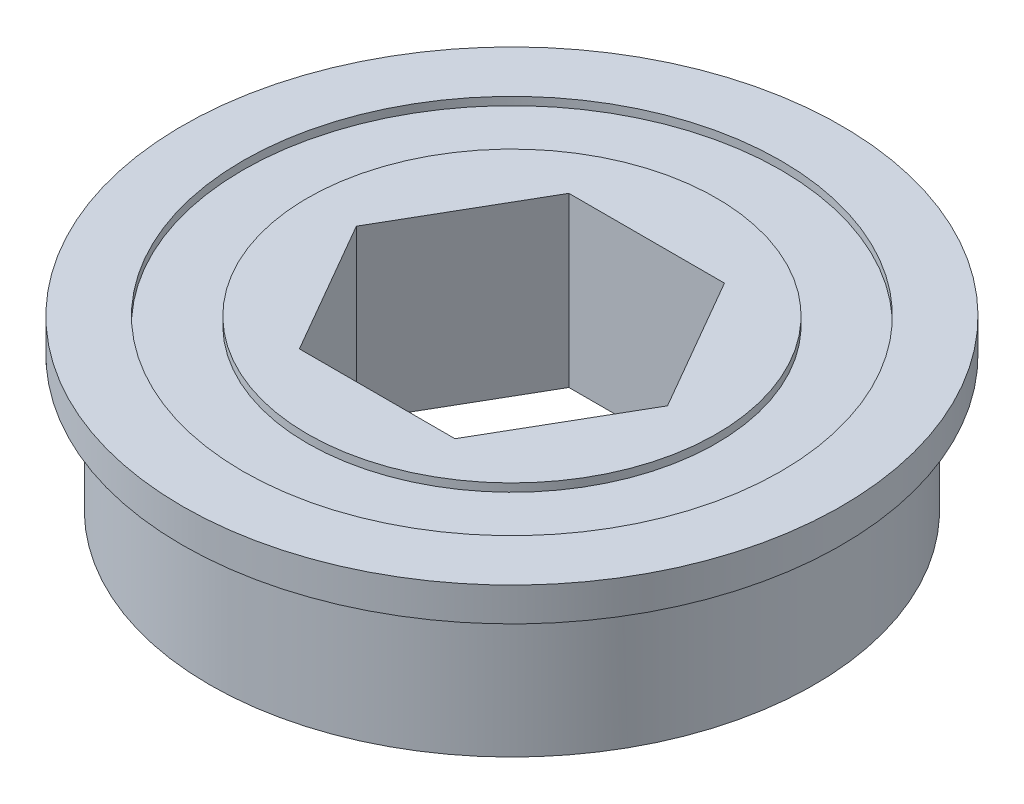
ISO-10303-21;
HEADER;
FILE_DESCRIPTION(('STEP AP214'),'2;1');
FILE_NAME('part.step','',(''),(''),'','','');
FILE_SCHEMA(('AUTOMOTIVE_DESIGN { 1 0 10303 214 1 1 1 1 }'));
ENDSEC;
DATA;
#1=APPLICATION_CONTEXT('core data for automotive mechanical design processes');
#2=APPLICATION_PROTOCOL_DEFINITION('international standard','automotive_design',2000,#1);
#3=PRODUCT_CONTEXT('',#1,'mechanical');
#4=PRODUCT('Part','Part','',(#3));
#5=PRODUCT_RELATED_PRODUCT_CATEGORY('part','',(#4));
#6=PRODUCT_DEFINITION_FORMATION('','',#4);
#7=PRODUCT_DEFINITION_CONTEXT('part definition',#1,'design');
#8=PRODUCT_DEFINITION('design','',#6,#7);
#9=PRODUCT_DEFINITION_SHAPE('','',#8);
#10=(LENGTH_UNIT() NAMED_UNIT(*) SI_UNIT(.MILLI.,.METRE.));
#11=(NAMED_UNIT(*) PLANE_ANGLE_UNIT() SI_UNIT($,.RADIAN.));
#12=(NAMED_UNIT(*) SI_UNIT($,.STERADIAN.) SOLID_ANGLE_UNIT());
#13=UNCERTAINTY_MEASURE_WITH_UNIT(LENGTH_MEASURE(1.E-05),#10,'distance_accuracy_value','');
#14=(GEOMETRIC_REPRESENTATION_CONTEXT(3) GLOBAL_UNCERTAINTY_ASSIGNED_CONTEXT((#13)) GLOBAL_UNIT_ASSIGNED_CONTEXT((#10,
#11,#12)) REPRESENTATION_CONTEXT('',''));
#15=CARTESIAN_POINT('',(0.,0.,0.));
#16=DIRECTION('',(0.,0.,1.));
#17=DIRECTION('',(1.,0.,0.));
#18=AXIS2_PLACEMENT_3D('',#15,#16,#17);
#19=CARTESIAN_POINT('',(9.652,0.,0.));
#20=DIRECTION('',(0.,-1.,0.));
#21=DIRECTION('',(0.,0.,-1.));
#22=AXIS2_PLACEMENT_3D('',#19,#20,#21);
#23=PLANE('',#22);
#24=DIRECTION('',(1.,0.,0.));
#25=VECTOR('',#24,1.);
#26=CARTESIAN_POINT('',(-3.67194771204601,0.,6.36));
#27=LINE('',#26,#25);
#28=CARTESIAN_POINT('',(-3.67194771204601,0.,6.36));
#29=VERTEX_POINT('',#28);
#30=CARTESIAN_POINT('',(3.67194771204602,0.,6.36));
#31=VERTEX_POINT('',#30);
#32=EDGE_CURVE('E91',#29,#31,#27,.T.);
#33=ORIENTED_EDGE('',*,*,#32,.T.);
#34=DIRECTION('',(0.5,0.,-0.866025403784439));
#35=VECTOR('',#34,1.);
#36=CARTESIAN_POINT('',(3.67194771204602,0.,6.36));
#37=LINE('',#36,#35);
#38=CARTESIAN_POINT('',(7.34389542409204,0.,0.));
#39=VERTEX_POINT('',#38);
#40=EDGE_CURVE('E93',#31,#39,#37,.T.);
#41=ORIENTED_EDGE('',*,*,#40,.T.);
#42=DIRECTION('',(-0.5,0.,-0.866025403784439));
#43=VECTOR('',#42,1.);
#44=CARTESIAN_POINT('',(7.34389542409204,0.,0.));
#45=LINE('',#44,#43);
#46=CARTESIAN_POINT('',(3.67194771204602,0.,-6.36));
#47=VERTEX_POINT('',#46);
#48=EDGE_CURVE('E96',#39,#47,#45,.T.);
#49=ORIENTED_EDGE('',*,*,#48,.T.);
#50=DIRECTION('',(-1.,0.,0.));
#51=VECTOR('',#50,1.);
#52=CARTESIAN_POINT('',(3.67194771204602,0.,-6.36));
#53=LINE('',#52,#51);
#54=CARTESIAN_POINT('',(-3.67194771204602,0.,-6.36));
#55=VERTEX_POINT('',#54);
#56=EDGE_CURVE('E233',#47,#55,#53,.T.);
#57=ORIENTED_EDGE('',*,*,#56,.T.);
#58=DIRECTION('',(-0.5,0.,0.866025403784439));
#59=VECTOR('',#58,1.);
#60=CARTESIAN_POINT('',(-3.67194771204602,0.,-6.36));
#61=LINE('',#60,#59);
#62=CARTESIAN_POINT('',(-7.34389542409204,0.,0.));
#63=VERTEX_POINT('',#62);
#64=EDGE_CURVE('E242',#55,#63,#61,.T.);
#65=ORIENTED_EDGE('',*,*,#64,.T.);
#66=DIRECTION('',(0.5,0.,0.866025403784439));
#67=VECTOR('',#66,1.);
#68=CARTESIAN_POINT('',(-7.34389542409204,0.,0.));
#69=LINE('',#68,#67);
#70=EDGE_CURVE('E249',#63,#29,#69,.T.);
#71=ORIENTED_EDGE('',*,*,#70,.T.);
#72=EDGE_LOOP('',(#33,#41,#49,#57,#65,#71));
#73=FACE_BOUND('',#72,.T.);
#74=CARTESIAN_POINT('',(0.,0.,0.));
#75=DIRECTION('',(0.,-1.,0.));
#76=DIRECTION('',(0.,0.,1.));
#77=AXIS2_PLACEMENT_3D('',#74,#75,#76);
#78=CIRCLE('',#77,9.652);
#79=CARTESIAN_POINT('',(0.,0.,9.652));
#80=VERTEX_POINT('',#79);
#81=EDGE_CURVE('E479',#80,#80,#78,.T.);
#82=ORIENTED_EDGE('',*,*,#81,.T.);
#83=EDGE_LOOP('',(#82));
#84=FACE_BOUND('',#83,.T.);
#85=ADVANCED_FACE('F44',(#73,#84),#23,.T.);
#86=CARTESIAN_POINT('',(0.,0.,0.));
#87=DIRECTION('',(0.,1.,0.));
#88=DIRECTION('',(0.,0.,1.));
#89=AXIS2_PLACEMENT_3D('',#86,#87,#88);
#90=CYLINDRICAL_SURFACE('',#89,14.2748);
#91=CARTESIAN_POINT('',(0.,0.,0.));
#92=DIRECTION('',(0.,1.,0.));
#93=DIRECTION('',(0.,0.,1.));
#94=AXIS2_PLACEMENT_3D('',#91,#92,#93);
#95=CIRCLE('',#94,14.2748);
#96=CARTESIAN_POINT('',(0.,0.,14.2748));
#97=VERTEX_POINT('',#96);
#98=EDGE_CURVE('E137',#97,#97,#95,.T.);
#99=ORIENTED_EDGE('',*,*,#98,.T.);
#100=EDGE_LOOP('',(#99));
#101=FACE_BOUND('',#100,.T.);
#102=CARTESIAN_POINT('',(0.,5.6,0.));
#103=DIRECTION('',(0.,-1.,0.));
#104=DIRECTION('',(0.,0.,-1.));
#105=AXIS2_PLACEMENT_3D('',#102,#103,#104);
#106=CIRCLE('',#105,14.2748);
#107=CARTESIAN_POINT('',(0.,5.6,-14.2748));
#108=VERTEX_POINT('',#107);
#109=EDGE_CURVE('E114',#108,#108,#106,.F.);
#110=ORIENTED_EDGE('',*,*,#109,.F.);
#111=EDGE_LOOP('',(#110));
#112=FACE_BOUND('',#111,.T.);
#113=ADVANCED_FACE('F46',(#101,#112),#90,.T.);
#114=CARTESIAN_POINT('',(0.,0.,0.));
#115=DIRECTION('',(0.,-1.,0.));
#116=DIRECTION('',(0.,0.,1.));
#117=AXIS2_PLACEMENT_3D('',#114,#115,#116);
#118=CIRCLE('',#117,12.7);
#119=CARTESIAN_POINT('',(0.,0.,12.7));
#120=VERTEX_POINT('',#119);
#121=EDGE_CURVE('E481',#120,#120,#118,.T.);
#122=ORIENTED_EDGE('',*,*,#121,.F.);
#123=EDGE_LOOP('',(#122));
#124=FACE_BOUND('',#123,.T.);
#125=ORIENTED_EDGE('',*,*,#98,.F.);
#126=EDGE_LOOP('',(#125));
#127=FACE_BOUND('',#126,.T.);
#128=ADVANCED_FACE('F288',(#124,#127),#23,.T.);
#129=CARTESIAN_POINT('',(0.,5.6,0.));
#130=DIRECTION('',(0.,-1.,0.));
#131=DIRECTION('',(0.,0.,-1.));
#132=AXIS2_PLACEMENT_3D('',#129,#130,#131);
#133=CONICAL_SURFACE('',#132,14.2748,0.523598775598298);
#134=CARTESIAN_POINT('',(0.,5.975,0.));
#135=DIRECTION('',(0.,1.,0.));
#136=DIRECTION('',(0.,0.,1.));
#137=AXIS2_PLACEMENT_3D('',#134,#135,#136);
#138=CIRCLE('',#137,14.0582936490539);
#139=CARTESIAN_POINT('',(0.,5.975,14.0582936490539));
#140=VERTEX_POINT('',#139);
#141=EDGE_CURVE('E129',#140,#140,#138,.F.);
#142=ORIENTED_EDGE('',*,*,#141,.T.);
#143=EDGE_LOOP('',(#142));
#144=FACE_BOUND('',#143,.T.);
#145=ORIENTED_EDGE('',*,*,#109,.T.);
#146=EDGE_LOOP('',(#145));
#147=FACE_BOUND('',#146,.T.);
#148=ADVANCED_FACE('F297',(#144,#147),#133,.T.);
#149=CARTESIAN_POINT('',(7.34389542409204,0.,0.));
#150=DIRECTION('',(0.866025403784439,0.,-0.5));
#151=DIRECTION('',(-0.5,0.,-0.866025403784439));
#152=AXIS2_PLACEMENT_3D('',#149,#150,#151);
#153=PLANE('',#152);
#154=DIRECTION('',(0.,1.,0.));
#155=VECTOR('',#154,1.);
#156=CARTESIAN_POINT('',(3.67194771204602,0.,-6.36));
#157=LINE('',#156,#155);
#158=CARTESIAN_POINT('',(3.67194771204602,7.9375,-6.36));
#159=VERTEX_POINT('',#158);
#160=EDGE_CURVE('E111',#159,#47,#157,.F.);
#161=ORIENTED_EDGE('',*,*,#160,.T.);
#162=ORIENTED_EDGE('',*,*,#48,.F.);
#163=DIRECTION('',(0.,1.,0.));
#164=VECTOR('',#163,1.);
#165=CARTESIAN_POINT('',(7.34389542409204,0.,0.));
#166=LINE('',#165,#164);
#167=CARTESIAN_POINT('',(7.34389542409204,7.9375,0.));
#168=VERTEX_POINT('',#167);
#169=EDGE_CURVE('E103',#39,#168,#166,.T.);
#170=ORIENTED_EDGE('',*,*,#169,.T.);
#171=DIRECTION('',(0.5,0.,0.866025403784438));
#172=VECTOR('',#171,1.);
#173=CARTESIAN_POINT('',(3.67194771204602,7.9375,-6.36));
#174=LINE('',#173,#172);
#175=EDGE_CURVE('E133',#159,#168,#174,.T.);
#176=ORIENTED_EDGE('',*,*,#175,.F.);
#177=EDGE_LOOP('',(#161,#162,#170,#176));
#178=FACE_BOUND('',#177,.T.);
#179=ADVANCED_FACE('F107',(#178),#153,.F.);
#180=CARTESIAN_POINT('',(3.67194771204602,0.,6.36));
#181=DIRECTION('',(0.866025403784439,0.,0.5));
#182=DIRECTION('',(0.5,0.,-0.866025403784439));
#183=AXIS2_PLACEMENT_3D('',#180,#181,#182);
#184=PLANE('',#183);
#185=ORIENTED_EDGE('',*,*,#169,.F.);
#186=ORIENTED_EDGE('',*,*,#40,.F.);
#187=DIRECTION('',(0.,1.,0.));
#188=VECTOR('',#187,1.);
#189=CARTESIAN_POINT('',(3.67194771204602,0.,6.36));
#190=LINE('',#189,#188);
#191=CARTESIAN_POINT('',(3.67194771204602,7.9375,6.36));
#192=VERTEX_POINT('',#191);
#193=EDGE_CURVE('E125',#31,#192,#190,.T.);
#194=ORIENTED_EDGE('',*,*,#193,.T.);
#195=DIRECTION('',(-0.5,0.,0.866025403784439));
#196=VECTOR('',#195,1.);
#197=CARTESIAN_POINT('',(7.34389542409204,7.9375,0.));
#198=LINE('',#197,#196);
#199=EDGE_CURVE('E118',#168,#192,#198,.T.);
#200=ORIENTED_EDGE('',*,*,#199,.F.);
#201=EDGE_LOOP('',(#185,#186,#194,#200));
#202=FACE_BOUND('',#201,.T.);
#203=ADVANCED_FACE('F116',(#202),#184,.F.);
#204=CARTESIAN_POINT('',(-3.67194771204601,0.,6.36));
#205=DIRECTION('',(0.,0.,1.));
#206=DIRECTION('',(1.,0.,0.));
#207=AXIS2_PLACEMENT_3D('',#204,#205,#206);
#208=PLANE('',#207);
#209=ORIENTED_EDGE('',*,*,#193,.F.);
#210=ORIENTED_EDGE('',*,*,#32,.F.);
#211=DIRECTION('',(0.,1.,0.));
#212=VECTOR('',#211,1.);
#213=CARTESIAN_POINT('',(-3.67194771204601,0.,6.36));
#214=LINE('',#213,#212);
#215=CARTESIAN_POINT('',(-3.67194771204601,7.9375,6.36));
#216=VERTEX_POINT('',#215);
#217=EDGE_CURVE('E245',#29,#216,#214,.T.);
#218=ORIENTED_EDGE('',*,*,#217,.T.);
#219=DIRECTION('',(1.,0.,0.));
#220=VECTOR('',#219,1.);
#221=CARTESIAN_POINT('',(6.35,7.9375,6.36));
#222=LINE('',#221,#220);
#223=EDGE_CURVE('E222',#192,#216,#222,.F.);
#224=ORIENTED_EDGE('',*,*,#223,.F.);
#225=EDGE_LOOP('',(#209,#210,#218,#224));
#226=FACE_BOUND('',#225,.T.);
#227=ADVANCED_FACE('F259',(#226),#208,.F.);
#228=CARTESIAN_POINT('',(-7.34389542409204,0.,0.));
#229=DIRECTION('',(-0.866025403784439,0.,0.5));
#230=DIRECTION('',(0.5,0.,0.866025403784439));
#231=AXIS2_PLACEMENT_3D('',#228,#229,#230);
#232=PLANE('',#231);
#233=ORIENTED_EDGE('',*,*,#217,.F.);
#234=ORIENTED_EDGE('',*,*,#70,.F.);
#235=DIRECTION('',(0.,1.,0.));
#236=VECTOR('',#235,1.);
#237=CARTESIAN_POINT('',(-7.34389542409204,0.,0.));
#238=LINE('',#237,#236);
#239=CARTESIAN_POINT('',(-7.34389542409204,7.9375,0.));
#240=VERTEX_POINT('',#239);
#241=EDGE_CURVE('E238',#63,#240,#238,.T.);
#242=ORIENTED_EDGE('',*,*,#241,.T.);
#243=DIRECTION('',(-0.5,0.,-0.866025403784439));
#244=VECTOR('',#243,1.);
#245=CARTESIAN_POINT('',(-3.67194771204601,7.9375,6.36));
#246=LINE('',#245,#244);
#247=EDGE_CURVE('E218',#216,#240,#246,.T.);
#248=ORIENTED_EDGE('',*,*,#247,.F.);
#249=EDGE_LOOP('',(#233,#234,#242,#248));
#250=FACE_BOUND('',#249,.T.);
#251=ADVANCED_FACE('F275',(#250),#232,.F.);
#252=CARTESIAN_POINT('',(-3.67194771204602,0.,-6.36));
#253=DIRECTION('',(-0.866025403784439,0.,-0.5));
#254=DIRECTION('',(-0.5,0.,0.866025403784439));
#255=AXIS2_PLACEMENT_3D('',#252,#253,#254);
#256=PLANE('',#255);
#257=ORIENTED_EDGE('',*,*,#241,.F.);
#258=ORIENTED_EDGE('',*,*,#64,.F.);
#259=DIRECTION('',(0.,1.,0.));
#260=VECTOR('',#259,1.);
#261=CARTESIAN_POINT('',(-3.67194771204602,0.,-6.36));
#262=LINE('',#261,#260);
#263=CARTESIAN_POINT('',(-3.67194771204602,7.9375,-6.36));
#264=VERTEX_POINT('',#263);
#265=EDGE_CURVE('E134',#55,#264,#262,.T.);
#266=ORIENTED_EDGE('',*,*,#265,.T.);
#267=DIRECTION('',(0.5,0.,-0.866025403784439));
#268=VECTOR('',#267,1.);
#269=CARTESIAN_POINT('',(-7.34389542409204,7.9375,0.));
#270=LINE('',#269,#268);
#271=EDGE_CURVE('E214',#240,#264,#270,.T.);
#272=ORIENTED_EDGE('',*,*,#271,.F.);
#273=EDGE_LOOP('',(#257,#258,#266,#272));
#274=FACE_BOUND('',#273,.T.);
#275=ADVANCED_FACE('F271',(#274),#256,.F.);
#276=CARTESIAN_POINT('',(3.67194771204602,0.,-6.36));
#277=DIRECTION('',(0.,0.,-1.));
#278=DIRECTION('',(-1.,0.,0.));
#279=AXIS2_PLACEMENT_3D('',#276,#277,#278);
#280=PLANE('',#279);
#281=ORIENTED_EDGE('',*,*,#265,.F.);
#282=ORIENTED_EDGE('',*,*,#56,.F.);
#283=ORIENTED_EDGE('',*,*,#160,.F.);
#284=DIRECTION('',(1.,0.,0.));
#285=VECTOR('',#284,1.);
#286=CARTESIAN_POINT('',(6.35,7.9375,-6.36));
#287=LINE('',#286,#285);
#288=EDGE_CURVE('E159',#264,#159,#287,.T.);
#289=ORIENTED_EDGE('',*,*,#288,.F.);
#290=EDGE_LOOP('',(#281,#282,#283,#289));
#291=FACE_BOUND('',#290,.T.);
#292=ADVANCED_FACE('F266',(#291),#280,.F.);
#293=CARTESIAN_POINT('',(6.35,7.9375,0.));
#294=DIRECTION('',(0.,1.,0.));
#295=DIRECTION('',(0.,0.,1.));
#296=AXIS2_PLACEMENT_3D('',#293,#294,#295);
#297=PLANE('',#296);
#298=CARTESIAN_POINT('',(0.,7.9375,0.));
#299=DIRECTION('',(0.,1.,0.));
#300=DIRECTION('',(0.,0.,1.));
#301=AXIS2_PLACEMENT_3D('',#298,#299,#300);
#302=CIRCLE('',#301,9.652);
#303=CARTESIAN_POINT('',(0.,7.9375,9.652));
#304=VERTEX_POINT('',#303);
#305=EDGE_CURVE('E154',#304,#304,#302,.F.);
#306=ORIENTED_EDGE('',*,*,#305,.F.);
#307=EDGE_LOOP('',(#306));
#308=FACE_BOUND('',#307,.T.);
#309=ORIENTED_EDGE('',*,*,#271,.T.);
#310=ORIENTED_EDGE('',*,*,#288,.T.);
#311=ORIENTED_EDGE('',*,*,#175,.T.);
#312=ORIENTED_EDGE('',*,*,#199,.T.);
#313=ORIENTED_EDGE('',*,*,#223,.T.);
#314=ORIENTED_EDGE('',*,*,#247,.T.);
#315=EDGE_LOOP('',(#309,#310,#311,#312,#313,#314));
#316=FACE_BOUND('',#315,.T.);
#317=ADVANCED_FACE('F198',(#308,#316),#297,.T.);
#318=CARTESIAN_POINT('',(0.,6.1,0.));
#319=DIRECTION('',(0.,1.,0.));
#320=DIRECTION('',(0.,0.,1.));
#321=AXIS2_PLACEMENT_3D('',#318,#319,#320);
#322=TOROIDAL_SURFACE('',#321,14.2748,0.25);
#323=ORIENTED_EDGE('',*,*,#141,.F.);
#324=EDGE_LOOP('',(#323));
#325=FACE_BOUND('',#324,.T.);
#326=CARTESIAN_POINT('',(0.,6.35,0.));
#327=DIRECTION('',(0.,-1.,0.));
#328=DIRECTION('',(0.,0.,-1.));
#329=AXIS2_PLACEMENT_3D('',#326,#327,#328);
#330=CIRCLE('',#329,14.2748);
#331=CARTESIAN_POINT('',(0.,6.35,14.2748));
#332=VERTEX_POINT('',#331);
#333=CARTESIAN_POINT('',(0.,6.35,-14.2748));
#334=VERTEX_POINT('',#333);
#335=EDGE_CURVE('E158',#332,#334,#330,.F.);
#336=ORIENTED_EDGE('',*,*,#335,.F.);
#337=CARTESIAN_POINT('',(0.,6.35,0.));
#338=DIRECTION('',(0.,-1.,0.));
#339=DIRECTION('',(0.,0.,1.));
#340=AXIS2_PLACEMENT_3D('',#337,#338,#339);
#341=CIRCLE('',#340,14.2748);
#342=EDGE_CURVE('E65',#334,#332,#341,.F.);
#343=ORIENTED_EDGE('',*,*,#342,.F.);
#344=EDGE_LOOP('',(#336,#343));
#345=FACE_BOUND('',#344,.T.);
#346=ADVANCED_FACE('F163',(#325,#345),#322,.F.);
#347=CARTESIAN_POINT('',(0.,0.,0.));
#348=DIRECTION('',(0.,1.,0.));
#349=DIRECTION('',(0.,0.,1.));
#350=AXIS2_PLACEMENT_3D('',#347,#348,#349);
#351=CYLINDRICAL_SURFACE('',#350,9.652);
#352=CARTESIAN_POINT('',(0.,7.5565,0.));
#353=DIRECTION('',(0.,1.,0.));
#354=DIRECTION('',(0.,0.,1.));
#355=AXIS2_PLACEMENT_3D('',#352,#353,#354);
#356=CIRCLE('',#355,9.652);
#357=CARTESIAN_POINT('',(0.,7.5565,9.652));
#358=VERTEX_POINT('',#357);
#359=EDGE_CURVE('E150',#358,#358,#356,.F.);
#360=ORIENTED_EDGE('',*,*,#359,.F.);
#361=EDGE_LOOP('',(#360));
#362=FACE_BOUND('',#361,.T.);
#363=ORIENTED_EDGE('',*,*,#305,.T.);
#364=EDGE_LOOP('',(#363));
#365=FACE_BOUND('',#364,.T.);
#366=ADVANCED_FACE('F189',(#362,#365),#351,.T.);
#367=CARTESIAN_POINT('',(15.5575,6.35,0.));
#368=DIRECTION('',(0.,-1.,0.));
#369=DIRECTION('',(0.,0.,-1.));
#370=AXIS2_PLACEMENT_3D('',#367,#368,#369);
#371=PLANE('',#370);
#372=CARTESIAN_POINT('',(0.,6.35,0.));
#373=DIRECTION('',(0.,1.,0.));
#374=DIRECTION('',(0.,0.,1.));
#375=AXIS2_PLACEMENT_3D('',#372,#373,#374);
#376=CIRCLE('',#375,15.5575);
#377=CARTESIAN_POINT('',(0.,6.35,15.5575));
#378=VERTEX_POINT('',#377);
#379=EDGE_CURVE('E146',#378,#378,#376,.T.);
#380=ORIENTED_EDGE('',*,*,#379,.F.);
#381=EDGE_LOOP('',(#380));
#382=FACE_BOUND('',#381,.T.);
#383=ORIENTED_EDGE('',*,*,#335,.T.);
#384=ORIENTED_EDGE('',*,*,#342,.T.);
#385=EDGE_LOOP('',(#383,#384));
#386=FACE_BOUND('',#385,.T.);
#387=ADVANCED_FACE('F168',(#382,#386),#371,.T.);
#388=CARTESIAN_POINT('',(9.652,7.5565,0.));
#389=DIRECTION('',(0.,1.,0.));
#390=DIRECTION('',(0.,0.,1.));
#391=AXIS2_PLACEMENT_3D('',#388,#389,#390);
#392=PLANE('',#391);
#393=ORIENTED_EDGE('',*,*,#359,.T.);
#394=EDGE_LOOP('',(#393));
#395=FACE_BOUND('',#394,.T.);
#396=CARTESIAN_POINT('',(0.,7.5565,0.));
#397=DIRECTION('',(0.,1.,0.));
#398=DIRECTION('',(0.,0.,1.));
#399=AXIS2_PLACEMENT_3D('',#396,#397,#398);
#400=CIRCLE('',#399,12.7);
#401=CARTESIAN_POINT('',(0.,7.5565,12.7));
#402=VERTEX_POINT('',#401);
#403=EDGE_CURVE('E142',#402,#402,#400,.T.);
#404=ORIENTED_EDGE('',*,*,#403,.T.);
#405=EDGE_LOOP('',(#404));
#406=FACE_BOUND('',#405,.T.);
#407=ADVANCED_FACE('F188',(#395,#406),#392,.T.);
#408=CARTESIAN_POINT('',(0.,0.,0.));
#409=DIRECTION('',(0.,1.,0.));
#410=DIRECTION('',(0.,0.,1.));
#411=AXIS2_PLACEMENT_3D('',#408,#409,#410);
#412=CYLINDRICAL_SURFACE('',#411,15.5575);
#413=ORIENTED_EDGE('',*,*,#379,.T.);
#414=EDGE_LOOP('',(#413));
#415=FACE_BOUND('',#414,.T.);
#416=CARTESIAN_POINT('',(0.,7.9375,0.));
#417=DIRECTION('',(0.,1.,0.));
#418=DIRECTION('',(0.,0.,1.));
#419=AXIS2_PLACEMENT_3D('',#416,#417,#418);
#420=CIRCLE('',#419,15.5575);
#421=CARTESIAN_POINT('',(0.,7.9375,15.5575));
#422=VERTEX_POINT('',#421);
#423=EDGE_CURVE('E57',#422,#422,#420,.T.);
#424=ORIENTED_EDGE('',*,*,#423,.F.);
#425=EDGE_LOOP('',(#424));
#426=FACE_BOUND('',#425,.T.);
#427=ADVANCED_FACE('F310',(#415,#426),#412,.T.);
#428=CARTESIAN_POINT('',(0.,0.,0.));
#429=DIRECTION('',(0.,1.,0.));
#430=DIRECTION('',(0.,0.,1.));
#431=AXIS2_PLACEMENT_3D('',#428,#429,#430);
#432=CYLINDRICAL_SURFACE('',#431,12.7);
#433=CARTESIAN_POINT('',(0.,7.9375,0.));
#434=DIRECTION('',(0.,1.,0.));
#435=DIRECTION('',(0.,0.,1.));
#436=AXIS2_PLACEMENT_3D('',#433,#434,#435);
#437=CIRCLE('',#436,12.7);
#438=CARTESIAN_POINT('',(0.,7.9375,12.7));
#439=VERTEX_POINT('',#438);
#440=EDGE_CURVE('E12',#439,#439,#437,.F.);
#441=ORIENTED_EDGE('',*,*,#440,.F.);
#442=EDGE_LOOP('',(#441));
#443=FACE_BOUND('',#442,.T.);
#444=ORIENTED_EDGE('',*,*,#403,.F.);
#445=EDGE_LOOP('',(#444));
#446=FACE_BOUND('',#445,.T.);
#447=ADVANCED_FACE('F300',(#443,#446),#432,.F.);
#448=CARTESIAN_POINT('',(12.7,7.9375,0.));
#449=DIRECTION('',(0.,1.,0.));
#450=DIRECTION('',(0.,0.,1.));
#451=AXIS2_PLACEMENT_3D('',#448,#449,#450);
#452=PLANE('',#451);
#453=ORIENTED_EDGE('',*,*,#440,.T.);
#454=EDGE_LOOP('',(#453));
#455=FACE_BOUND('',#454,.T.);
#456=ORIENTED_EDGE('',*,*,#423,.T.);
#457=EDGE_LOOP('',(#456));
#458=FACE_BOUND('',#457,.T.);
#459=ADVANCED_FACE('F289',(#455,#458),#452,.T.);
#460=CARTESIAN_POINT('',(0.,0.381,0.));
#461=DIRECTION('',(0.,-1.,0.));
#462=DIRECTION('',(0.,0.,-1.));
#463=AXIS2_PLACEMENT_3D('',#460,#461,#462);
#464=CYLINDRICAL_SURFACE('',#463,12.7);
#465=CARTESIAN_POINT('',(0.,0.381,0.));
#466=DIRECTION('',(0.,-1.,0.));
#467=DIRECTION('',(0.,0.,1.));
#468=AXIS2_PLACEMENT_3D('',#465,#466,#467);
#469=CIRCLE('',#468,12.7);
#470=CARTESIAN_POINT('',(0.,0.381,12.7));
#471=VERTEX_POINT('',#470);
#472=EDGE_CURVE('E162',#471,#471,#469,.T.);
#473=ORIENTED_EDGE('',*,*,#472,.F.);
#474=EDGE_LOOP('',(#473));
#475=FACE_BOUND('',#474,.T.);
#476=ORIENTED_EDGE('',*,*,#121,.T.);
#477=EDGE_LOOP('',(#476));
#478=FACE_BOUND('',#477,.T.);
#479=ADVANCED_FACE('F294',(#475,#478),#464,.F.);
#480=CARTESIAN_POINT('',(0.,0.381,0.));
#481=DIRECTION('',(0.,1.,0.));
#482=DIRECTION('',(0.,0.,1.));
#483=AXIS2_PLACEMENT_3D('',#480,#481,#482);
#484=PLANE('',#483);
#485=CARTESIAN_POINT('',(0.,0.381,0.));
#486=DIRECTION('',(0.,-1.,0.));
#487=DIRECTION('',(0.,0.,1.));
#488=AXIS2_PLACEMENT_3D('',#485,#486,#487);
#489=CIRCLE('',#488,9.652);
#490=CARTESIAN_POINT('',(0.,0.381,9.652));
#491=VERTEX_POINT('',#490);
#492=EDGE_CURVE('E476',#491,#491,#489,.T.);
#493=ORIENTED_EDGE('',*,*,#492,.F.);
#494=EDGE_LOOP('',(#493));
#495=FACE_BOUND('',#494,.T.);
#496=ORIENTED_EDGE('',*,*,#472,.T.);
#497=EDGE_LOOP('',(#496));
#498=FACE_BOUND('',#497,.T.);
#499=ADVANCED_FACE('F307',(#495,#498),#484,.F.);
#500=CARTESIAN_POINT('',(0.,0.381,0.));
#501=DIRECTION('',(0.,-1.,0.));
#502=DIRECTION('',(0.,0.,-1.));
#503=AXIS2_PLACEMENT_3D('',#500,#501,#502);
#504=CYLINDRICAL_SURFACE('',#503,9.652);
#505=ORIENTED_EDGE('',*,*,#492,.T.);
#506=EDGE_LOOP('',(#505));
#507=FACE_BOUND('',#506,.T.);
#508=ORIENTED_EDGE('',*,*,#81,.F.);
#509=EDGE_LOOP('',(#508));
#510=FACE_BOUND('',#509,.T.);
#511=ADVANCED_FACE('F460',(#507,#510),#504,.T.);
#512=CLOSED_SHELL('',(#85,#113,#128,#148,#179,#203,#227,#251,#275,#292,#317,#346,#366,#387,#407,
#427,#447,#459,#479,#499,#511));
#513=MANIFOLD_SOLID_BREP('B2',#512);
#514=ADVANCED_BREP_SHAPE_REPRESENTATION('',(#18,#513),#14);
#515=SHAPE_DEFINITION_REPRESENTATION(#9,#514);
ENDSEC;
END-ISO-10303-21;
